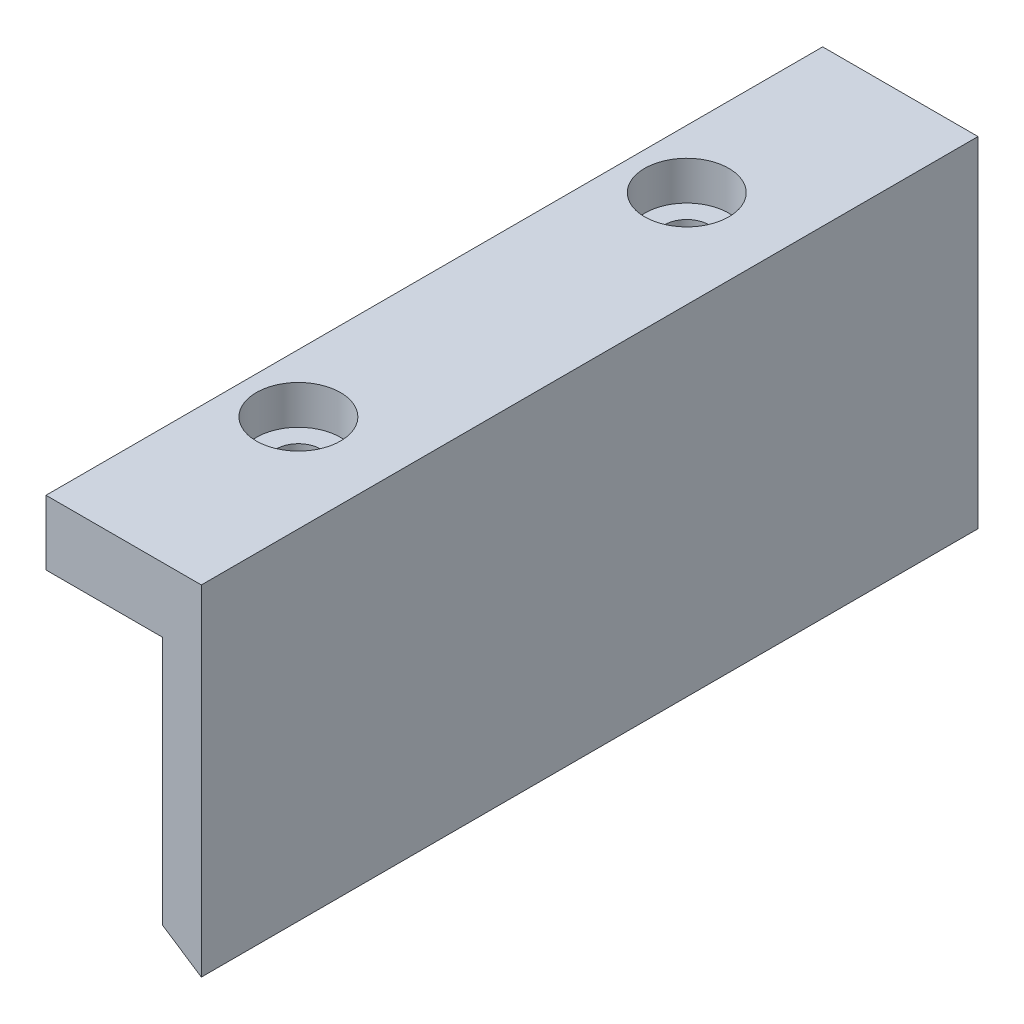
ISO-10303-21;
HEADER;
FILE_DESCRIPTION(('STEP AP214'),'2;1');
FILE_NAME('part.step','',(''),(''),'','','');
FILE_SCHEMA(('AUTOMOTIVE_DESIGN { 1 0 10303 214 1 1 1 1 }'));
ENDSEC;
DATA;
#1=APPLICATION_CONTEXT('core data for automotive mechanical design processes');
#2=APPLICATION_PROTOCOL_DEFINITION('international standard','automotive_design',2000,#1);
#3=PRODUCT_CONTEXT('',#1,'mechanical');
#4=PRODUCT('Part','Part','',(#3));
#5=PRODUCT_RELATED_PRODUCT_CATEGORY('part','',(#4));
#6=PRODUCT_DEFINITION_FORMATION('','',#4);
#7=PRODUCT_DEFINITION_CONTEXT('part definition',#1,'design');
#8=PRODUCT_DEFINITION('design','',#6,#7);
#9=PRODUCT_DEFINITION_SHAPE('','',#8);
#10=(LENGTH_UNIT() NAMED_UNIT(*) SI_UNIT(.MILLI.,.METRE.));
#11=(NAMED_UNIT(*) PLANE_ANGLE_UNIT() SI_UNIT($,.RADIAN.));
#12=(NAMED_UNIT(*) SI_UNIT($,.STERADIAN.) SOLID_ANGLE_UNIT());
#13=UNCERTAINTY_MEASURE_WITH_UNIT(LENGTH_MEASURE(1.E-05),#10,'distance_accuracy_value','');
#14=(GEOMETRIC_REPRESENTATION_CONTEXT(3) GLOBAL_UNCERTAINTY_ASSIGNED_CONTEXT((#13)) GLOBAL_UNIT_ASSIGNED_CONTEXT((#10,
#11,#12)) REPRESENTATION_CONTEXT('',''));
#15=CARTESIAN_POINT('',(0.,0.,0.));
#16=DIRECTION('',(0.,0.,1.));
#17=DIRECTION('',(1.,0.,0.));
#18=AXIS2_PLACEMENT_3D('',#15,#16,#17);
#19=CARTESIAN_POINT('',(0.,60.2,60.));
#20=DIRECTION('',(0.,-1.,0.));
#21=DIRECTION('',(0.,0.,-1.));
#22=AXIS2_PLACEMENT_3D('',#19,#20,#21);
#23=PLANE('',#22);
#24=CARTESIAN_POINT('',(-7.5,60.2,15.));
#25=DIRECTION('',(0.,1.,0.));
#26=DIRECTION('',(0.,0.,1.));
#27=AXIS2_PLACEMENT_3D('',#24,#25,#26);
#28=CIRCLE('',#27,3.25);
#29=CARTESIAN_POINT('',(-7.5,60.2,18.25));
#30=VERTEX_POINT('',#29);
#31=EDGE_CURVE('E163',#30,#30,#28,.T.);
#32=ORIENTED_EDGE('',*,*,#31,.F.);
#33=EDGE_LOOP('',(#32));
#34=FACE_BOUND('',#33,.T.);
#35=CARTESIAN_POINT('',(-7.5,60.2,45.));
#36=DIRECTION('',(0.,1.,0.));
#37=DIRECTION('',(0.,0.,1.));
#38=AXIS2_PLACEMENT_3D('',#35,#36,#37);
#39=CIRCLE('',#38,3.25);
#40=CARTESIAN_POINT('',(-7.5,60.2,48.25));
#41=VERTEX_POINT('',#40);
#42=EDGE_CURVE('E166',#41,#41,#39,.T.);
#43=ORIENTED_EDGE('',*,*,#42,.F.);
#44=EDGE_LOOP('',(#43));
#45=FACE_BOUND('',#44,.T.);
#46=DIRECTION('',(-1.,0.,0.));
#47=VECTOR('',#46,1.);
#48=CARTESIAN_POINT('',(0.,60.2,0.));
#49=LINE('',#48,#47);
#50=CARTESIAN_POINT('',(0.,60.2,0.));
#51=VERTEX_POINT('',#50);
#52=CARTESIAN_POINT('',(-12.,60.2,0.));
#53=VERTEX_POINT('',#52);
#54=EDGE_CURVE('E120',#51,#53,#49,.T.);
#55=ORIENTED_EDGE('',*,*,#54,.T.);
#56=DIRECTION('',(0.,0.,-1.));
#57=VECTOR('',#56,1.);
#58=CARTESIAN_POINT('',(-12.,60.2,60.));
#59=LINE('',#58,#57);
#60=CARTESIAN_POINT('',(-12.,60.2,60.));
#61=VERTEX_POINT('',#60);
#62=EDGE_CURVE('E11',#61,#53,#59,.T.);
#63=ORIENTED_EDGE('',*,*,#62,.F.);
#64=DIRECTION('',(-1.,0.,0.));
#65=VECTOR('',#64,1.);
#66=CARTESIAN_POINT('',(0.,60.2,60.));
#67=LINE('',#66,#65);
#68=CARTESIAN_POINT('',(0.,60.2,60.));
#69=VERTEX_POINT('',#68);
#70=EDGE_CURVE('E131',#69,#61,#67,.T.);
#71=ORIENTED_EDGE('',*,*,#70,.F.);
#72=DIRECTION('',(0.,0.,-1.));
#73=VECTOR('',#72,1.);
#74=CARTESIAN_POINT('',(0.,60.2,60.));
#75=LINE('',#74,#73);
#76=EDGE_CURVE('E116',#69,#51,#75,.T.);
#77=ORIENTED_EDGE('',*,*,#76,.T.);
#78=EDGE_LOOP('',(#55,#63,#71,#77));
#79=FACE_BOUND('',#78,.T.);
#80=ADVANCED_FACE('F36',(#34,#45,#79),#23,.F.);
#81=CARTESIAN_POINT('',(-12.,60.2,60.));
#82=DIRECTION('',(1.,0.,0.));
#83=DIRECTION('',(0.,0.,-1.));
#84=AXIS2_PLACEMENT_3D('',#81,#82,#83);
#85=PLANE('',#84);
#86=DIRECTION('',(0.,-1.,0.));
#87=VECTOR('',#86,1.);
#88=CARTESIAN_POINT('',(-12.,60.2,0.));
#89=LINE('',#88,#87);
#90=CARTESIAN_POINT('',(-12.,55.2,0.));
#91=VERTEX_POINT('',#90);
#92=EDGE_CURVE('E123',#53,#91,#89,.T.);
#93=ORIENTED_EDGE('',*,*,#92,.T.);
#94=DIRECTION('',(0.,0.,-1.));
#95=VECTOR('',#94,1.);
#96=CARTESIAN_POINT('',(-12.,55.2,60.));
#97=LINE('',#96,#95);
#98=CARTESIAN_POINT('',(-12.,55.2,60.));
#99=VERTEX_POINT('',#98);
#100=EDGE_CURVE('E44',#99,#91,#97,.T.);
#101=ORIENTED_EDGE('',*,*,#100,.F.);
#102=DIRECTION('',(0.,-1.,0.));
#103=VECTOR('',#102,1.);
#104=CARTESIAN_POINT('',(-12.,60.2,60.));
#105=LINE('',#104,#103);
#106=EDGE_CURVE('E89',#61,#99,#105,.T.);
#107=ORIENTED_EDGE('',*,*,#106,.F.);
#108=ORIENTED_EDGE('',*,*,#62,.T.);
#109=EDGE_LOOP('',(#93,#101,#107,#108));
#110=FACE_BOUND('',#109,.T.);
#111=ADVANCED_FACE('F155',(#110),#85,.F.);
#112=CARTESIAN_POINT('',(-12.,55.2,60.));
#113=DIRECTION('',(0.,1.,0.));
#114=DIRECTION('',(0.,0.,1.));
#115=AXIS2_PLACEMENT_3D('',#112,#113,#114);
#116=PLANE('',#115);
#117=CARTESIAN_POINT('',(-7.5,55.2,15.));
#118=DIRECTION('',(0.,1.,0.));
#119=DIRECTION('',(0.,0.,1.));
#120=AXIS2_PLACEMENT_3D('',#117,#118,#119);
#121=CIRCLE('',#120,1.7);
#122=CARTESIAN_POINT('',(-7.5,55.2,16.7));
#123=VERTEX_POINT('',#122);
#124=EDGE_CURVE('E169',#123,#123,#121,.F.);
#125=ORIENTED_EDGE('',*,*,#124,.F.);
#126=EDGE_LOOP('',(#125));
#127=FACE_BOUND('',#126,.T.);
#128=CARTESIAN_POINT('',(-7.5,55.2,45.));
#129=DIRECTION('',(0.,1.,0.));
#130=DIRECTION('',(0.,0.,1.));
#131=AXIS2_PLACEMENT_3D('',#128,#129,#130);
#132=CIRCLE('',#131,1.7);
#133=CARTESIAN_POINT('',(-7.5,55.2,46.7));
#134=VERTEX_POINT('',#133);
#135=EDGE_CURVE('E124',#134,#134,#132,.F.);
#136=ORIENTED_EDGE('',*,*,#135,.F.);
#137=EDGE_LOOP('',(#136));
#138=FACE_BOUND('',#137,.T.);
#139=DIRECTION('',(1.,0.,0.));
#140=VECTOR('',#139,1.);
#141=CARTESIAN_POINT('',(-12.,55.2,0.));
#142=LINE('',#141,#140);
#143=CARTESIAN_POINT('',(-3.00000000000001,55.2,0.));
#144=VERTEX_POINT('',#143);
#145=EDGE_CURVE('E126',#91,#144,#142,.T.);
#146=ORIENTED_EDGE('',*,*,#145,.T.);
#147=DIRECTION('',(0.,0.,-1.));
#148=VECTOR('',#147,1.);
#149=CARTESIAN_POINT('',(-3.00000000000001,55.2,60.));
#150=LINE('',#149,#148);
#151=CARTESIAN_POINT('',(-3.00000000000001,55.2,60.));
#152=VERTEX_POINT('',#151);
#153=EDGE_CURVE('E111',#152,#144,#150,.T.);
#154=ORIENTED_EDGE('',*,*,#153,.F.);
#155=DIRECTION('',(1.,0.,0.));
#156=VECTOR('',#155,1.);
#157=CARTESIAN_POINT('',(-12.,55.2,60.));
#158=LINE('',#157,#156);
#159=EDGE_CURVE('E102',#99,#152,#158,.T.);
#160=ORIENTED_EDGE('',*,*,#159,.F.);
#161=ORIENTED_EDGE('',*,*,#100,.T.);
#162=EDGE_LOOP('',(#146,#154,#160,#161));
#163=FACE_BOUND('',#162,.T.);
#164=ADVANCED_FACE('F137',(#127,#138,#163),#116,.F.);
#165=CARTESIAN_POINT('',(-3.00000000000001,55.2,60.));
#166=DIRECTION('',(1.,0.,0.));
#167=DIRECTION('',(0.,1.,0.));
#168=AXIS2_PLACEMENT_3D('',#165,#166,#167);
#169=PLANE('',#168);
#170=DIRECTION('',(0.,-1.,0.));
#171=VECTOR('',#170,1.);
#172=CARTESIAN_POINT('',(-3.00000000000001,55.2,0.));
#173=LINE('',#172,#171);
#174=CARTESIAN_POINT('',(-3.,35.94,0.));
#175=VERTEX_POINT('',#174);
#176=EDGE_CURVE('E110',#144,#175,#173,.T.);
#177=ORIENTED_EDGE('',*,*,#176,.T.);
#178=DIRECTION('',(0.,0.,-1.));
#179=VECTOR('',#178,1.);
#180=CARTESIAN_POINT('',(-3.,35.94,60.));
#181=LINE('',#180,#179);
#182=CARTESIAN_POINT('',(-3.,35.94,60.));
#183=VERTEX_POINT('',#182);
#184=EDGE_CURVE('E107',#183,#175,#181,.T.);
#185=ORIENTED_EDGE('',*,*,#184,.F.);
#186=DIRECTION('',(0.,-1.,0.));
#187=VECTOR('',#186,1.);
#188=CARTESIAN_POINT('',(-3.00000000000001,55.2,60.));
#189=LINE('',#188,#187);
#190=EDGE_CURVE('E96',#152,#183,#189,.T.);
#191=ORIENTED_EDGE('',*,*,#190,.F.);
#192=ORIENTED_EDGE('',*,*,#153,.T.);
#193=EDGE_LOOP('',(#177,#185,#191,#192));
#194=FACE_BOUND('',#193,.T.);
#195=ADVANCED_FACE('F108',(#194),#169,.F.);
#196=CARTESIAN_POINT('',(0.,33.96,60.));
#197=DIRECTION('',(0.550842208330739,0.834609406561725,0.));
#198=DIRECTION('',(-0.834609406561725,0.550842208330739,0.));
#199=AXIS2_PLACEMENT_3D('',#196,#197,#198);
#200=PLANE('',#199);
#201=DIRECTION('',(0.834609406561725,-0.550842208330739,0.));
#202=VECTOR('',#201,1.);
#203=CARTESIAN_POINT('',(0.,33.96,0.));
#204=LINE('',#203,#202);
#205=CARTESIAN_POINT('',(0.,33.96,0.));
#206=VERTEX_POINT('',#205);
#207=EDGE_CURVE('E75',#175,#206,#204,.T.);
#208=ORIENTED_EDGE('',*,*,#207,.T.);
#209=DIRECTION('',(0.,0.,-1.));
#210=VECTOR('',#209,1.);
#211=CARTESIAN_POINT('',(0.,33.96,60.));
#212=LINE('',#211,#210);
#213=CARTESIAN_POINT('',(0.,33.96,60.));
#214=VERTEX_POINT('',#213);
#215=EDGE_CURVE('E112',#214,#206,#212,.T.);
#216=ORIENTED_EDGE('',*,*,#215,.F.);
#217=DIRECTION('',(0.834609406561725,-0.550842208330739,0.));
#218=VECTOR('',#217,1.);
#219=CARTESIAN_POINT('',(0.,33.96,60.));
#220=LINE('',#219,#218);
#221=EDGE_CURVE('E100',#183,#214,#220,.T.);
#222=ORIENTED_EDGE('',*,*,#221,.F.);
#223=ORIENTED_EDGE('',*,*,#184,.T.);
#224=EDGE_LOOP('',(#208,#216,#222,#223));
#225=FACE_BOUND('',#224,.T.);
#226=ADVANCED_FACE('F114',(#225),#200,.F.);
#227=CARTESIAN_POINT('',(0.,60.2,60.));
#228=DIRECTION('',(-1.,0.,0.));
#229=DIRECTION('',(0.,0.,1.));
#230=AXIS2_PLACEMENT_3D('',#227,#228,#229);
#231=PLANE('',#230);
#232=DIRECTION('',(0.,1.,0.));
#233=VECTOR('',#232,1.);
#234=CARTESIAN_POINT('',(0.,60.2,0.));
#235=LINE('',#234,#233);
#236=EDGE_CURVE('E81',#206,#51,#235,.T.);
#237=ORIENTED_EDGE('',*,*,#236,.T.);
#238=ORIENTED_EDGE('',*,*,#76,.F.);
#239=DIRECTION('',(0.,1.,0.));
#240=VECTOR('',#239,1.);
#241=CARTESIAN_POINT('',(0.,60.2,60.));
#242=LINE('',#241,#240);
#243=EDGE_CURVE('E52',#214,#69,#242,.T.);
#244=ORIENTED_EDGE('',*,*,#243,.F.);
#245=ORIENTED_EDGE('',*,*,#215,.T.);
#246=EDGE_LOOP('',(#237,#238,#244,#245));
#247=FACE_BOUND('',#246,.T.);
#248=ADVANCED_FACE('F144',(#247),#231,.F.);
#249=CARTESIAN_POINT('',(0.,0.,60.));
#250=DIRECTION('',(0.,0.,1.));
#251=DIRECTION('',(1.,0.,0.));
#252=AXIS2_PLACEMENT_3D('',#249,#250,#251);
#253=PLANE('',#252);
#254=ORIENTED_EDGE('',*,*,#70,.T.);
#255=ORIENTED_EDGE('',*,*,#106,.T.);
#256=ORIENTED_EDGE('',*,*,#159,.T.);
#257=ORIENTED_EDGE('',*,*,#190,.T.);
#258=ORIENTED_EDGE('',*,*,#221,.T.);
#259=ORIENTED_EDGE('',*,*,#243,.T.);
#260=EDGE_LOOP('',(#254,#255,#256,#257,#258,#259));
#261=FACE_BOUND('',#260,.T.);
#262=ADVANCED_FACE('F98',(#261),#253,.T.);
#263=CARTESIAN_POINT('',(0.,0.,0.));
#264=DIRECTION('',(0.,0.,1.));
#265=DIRECTION('',(1.,0.,0.));
#266=AXIS2_PLACEMENT_3D('',#263,#264,#265);
#267=PLANE('',#266);
#268=ORIENTED_EDGE('',*,*,#54,.F.);
#269=ORIENTED_EDGE('',*,*,#236,.F.);
#270=ORIENTED_EDGE('',*,*,#207,.F.);
#271=ORIENTED_EDGE('',*,*,#176,.F.);
#272=ORIENTED_EDGE('',*,*,#145,.F.);
#273=ORIENTED_EDGE('',*,*,#92,.F.);
#274=EDGE_LOOP('',(#268,#269,#270,#271,#272,#273));
#275=FACE_BOUND('',#274,.T.);
#276=ADVANCED_FACE('F140',(#275),#267,.F.);
#277=CARTESIAN_POINT('',(-7.5,60.2,45.));
#278=DIRECTION('',(0.,1.,0.));
#279=DIRECTION('',(0.,0.,1.));
#280=AXIS2_PLACEMENT_3D('',#277,#278,#279);
#281=CYLINDRICAL_SURFACE('',#280,1.7);
#282=ORIENTED_EDGE('',*,*,#135,.T.);
#283=EDGE_LOOP('',(#282));
#284=FACE_BOUND('',#283,.T.);
#285=CARTESIAN_POINT('',(-7.5,57.2,45.));
#286=DIRECTION('',(0.,1.,0.));
#287=DIRECTION('',(0.,0.,1.));
#288=AXIS2_PLACEMENT_3D('',#285,#286,#287);
#289=CIRCLE('',#288,1.7);
#290=CARTESIAN_POINT('',(-7.5,57.2,46.7));
#291=VERTEX_POINT('',#290);
#292=EDGE_CURVE('E172',#291,#291,#289,.T.);
#293=ORIENTED_EDGE('',*,*,#292,.T.);
#294=EDGE_LOOP('',(#293));
#295=FACE_BOUND('',#294,.T.);
#296=ADVANCED_FACE('F188',(#284,#295),#281,.F.);
#297=CARTESIAN_POINT('',(-5.80000000000001,57.2,45.));
#298=DIRECTION('',(0.,-1.,0.));
#299=DIRECTION('',(0.,0.,-1.));
#300=AXIS2_PLACEMENT_3D('',#297,#298,#299);
#301=PLANE('',#300);
#302=ORIENTED_EDGE('',*,*,#292,.F.);
#303=EDGE_LOOP('',(#302));
#304=FACE_BOUND('',#303,.T.);
#305=CARTESIAN_POINT('',(-7.5,57.2,45.));
#306=DIRECTION('',(0.,1.,0.));
#307=DIRECTION('',(0.,0.,1.));
#308=AXIS2_PLACEMENT_3D('',#305,#306,#307);
#309=CIRCLE('',#308,3.25);
#310=CARTESIAN_POINT('',(-7.5,57.2,48.25));
#311=VERTEX_POINT('',#310);
#312=EDGE_CURVE('E168',#311,#311,#309,.T.);
#313=ORIENTED_EDGE('',*,*,#312,.T.);
#314=EDGE_LOOP('',(#313));
#315=FACE_BOUND('',#314,.T.);
#316=ADVANCED_FACE('F225',(#304,#315),#301,.F.);
#317=CARTESIAN_POINT('',(-7.5,60.2,45.));
#318=DIRECTION('',(0.,1.,0.));
#319=DIRECTION('',(0.,0.,1.));
#320=AXIS2_PLACEMENT_3D('',#317,#318,#319);
#321=CYLINDRICAL_SURFACE('',#320,3.25);
#322=ORIENTED_EDGE('',*,*,#312,.F.);
#323=EDGE_LOOP('',(#322));
#324=FACE_BOUND('',#323,.T.);
#325=ORIENTED_EDGE('',*,*,#42,.T.);
#326=EDGE_LOOP('',(#325));
#327=FACE_BOUND('',#326,.T.);
#328=ADVANCED_FACE('F203',(#324,#327),#321,.F.);
#329=CARTESIAN_POINT('',(-7.5,60.2,15.));
#330=DIRECTION('',(0.,1.,0.));
#331=DIRECTION('',(0.,0.,1.));
#332=AXIS2_PLACEMENT_3D('',#329,#330,#331);
#333=CYLINDRICAL_SURFACE('',#332,1.7);
#334=ORIENTED_EDGE('',*,*,#124,.T.);
#335=EDGE_LOOP('',(#334));
#336=FACE_BOUND('',#335,.T.);
#337=CARTESIAN_POINT('',(-7.5,57.2,15.));
#338=DIRECTION('',(0.,1.,0.));
#339=DIRECTION('',(0.,0.,1.));
#340=AXIS2_PLACEMENT_3D('',#337,#338,#339);
#341=CIRCLE('',#340,1.7);
#342=CARTESIAN_POINT('',(-7.5,57.2,16.7));
#343=VERTEX_POINT('',#342);
#344=EDGE_CURVE('E175',#343,#343,#341,.T.);
#345=ORIENTED_EDGE('',*,*,#344,.T.);
#346=EDGE_LOOP('',(#345));
#347=FACE_BOUND('',#346,.T.);
#348=ADVANCED_FACE('F199',(#336,#347),#333,.F.);
#349=CARTESIAN_POINT('',(-5.80000000000001,57.2,15.));
#350=DIRECTION('',(0.,-1.,0.));
#351=DIRECTION('',(0.,0.,-1.));
#352=AXIS2_PLACEMENT_3D('',#349,#350,#351);
#353=PLANE('',#352);
#354=ORIENTED_EDGE('',*,*,#344,.F.);
#355=EDGE_LOOP('',(#354));
#356=FACE_BOUND('',#355,.T.);
#357=CARTESIAN_POINT('',(-7.5,57.2,15.));
#358=DIRECTION('',(0.,1.,0.));
#359=DIRECTION('',(0.,0.,1.));
#360=AXIS2_PLACEMENT_3D('',#357,#358,#359);
#361=CIRCLE('',#360,3.25);
#362=CARTESIAN_POINT('',(-7.5,57.2,18.25));
#363=VERTEX_POINT('',#362);
#364=EDGE_CURVE('E208',#363,#363,#361,.T.);
#365=ORIENTED_EDGE('',*,*,#364,.T.);
#366=EDGE_LOOP('',(#365));
#367=FACE_BOUND('',#366,.T.);
#368=ADVANCED_FACE('F202',(#356,#367),#353,.F.);
#369=CARTESIAN_POINT('',(-7.5,60.2,15.));
#370=DIRECTION('',(0.,1.,0.));
#371=DIRECTION('',(0.,0.,1.));
#372=AXIS2_PLACEMENT_3D('',#369,#370,#371);
#373=CYLINDRICAL_SURFACE('',#372,3.25);
#374=ORIENTED_EDGE('',*,*,#364,.F.);
#375=EDGE_LOOP('',(#374));
#376=FACE_BOUND('',#375,.T.);
#377=ORIENTED_EDGE('',*,*,#31,.T.);
#378=EDGE_LOOP('',(#377));
#379=FACE_BOUND('',#378,.T.);
#380=ADVANCED_FACE('F213',(#376,#379),#373,.F.);
#381=CLOSED_SHELL('',(#80,#111,#164,#195,#226,#248,#262,#276,#296,#316,#328,#348,#368,#380));
#382=MANIFOLD_SOLID_BREP('B2',#381);
#383=ADVANCED_BREP_SHAPE_REPRESENTATION('',(#18,#382),#14);
#384=SHAPE_DEFINITION_REPRESENTATION(#9,#383);
ENDSEC;
END-ISO-10303-21;
